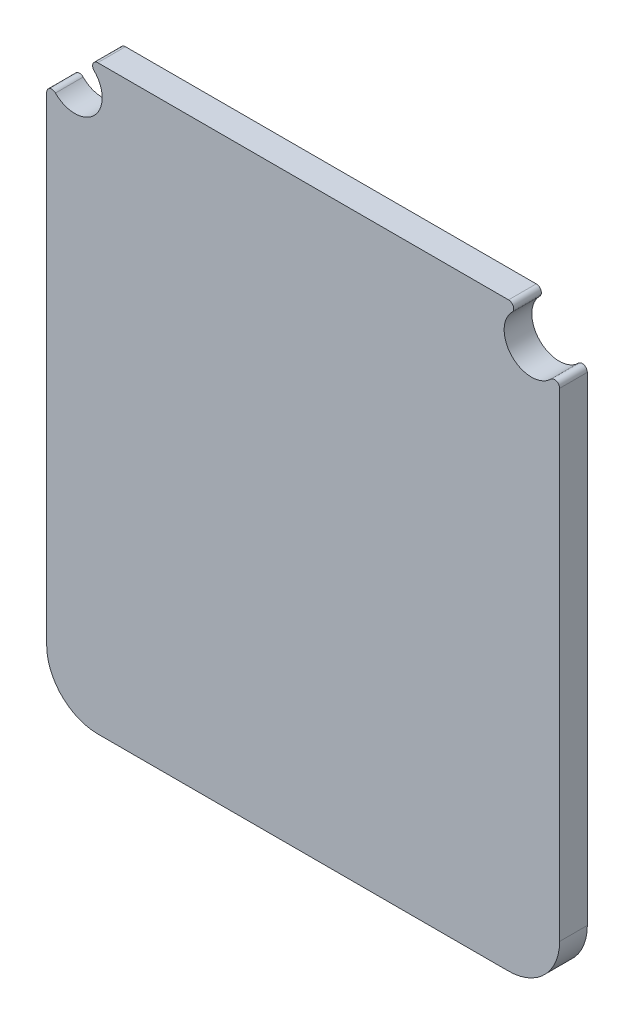
ISO-10303-21;
HEADER;
FILE_DESCRIPTION(('STEP AP214'),'2;1');
FILE_NAME('part.step','',(''),(''),'','','');
FILE_SCHEMA(('AUTOMOTIVE_DESIGN { 1 0 10303 214 1 1 1 1 }'));
ENDSEC;
DATA;
#1=APPLICATION_CONTEXT('core data for automotive mechanical design processes');
#2=APPLICATION_PROTOCOL_DEFINITION('international standard','automotive_design',2000,#1);
#3=PRODUCT_CONTEXT('',#1,'mechanical');
#4=PRODUCT('Part','Part','',(#3));
#5=PRODUCT_RELATED_PRODUCT_CATEGORY('part','',(#4));
#6=PRODUCT_DEFINITION_FORMATION('','',#4);
#7=PRODUCT_DEFINITION_CONTEXT('part definition',#1,'design');
#8=PRODUCT_DEFINITION('design','',#6,#7);
#9=PRODUCT_DEFINITION_SHAPE('','',#8);
#10=(LENGTH_UNIT() NAMED_UNIT(*) SI_UNIT(.MILLI.,.METRE.));
#11=(NAMED_UNIT(*) PLANE_ANGLE_UNIT() SI_UNIT($,.RADIAN.));
#12=(NAMED_UNIT(*) SI_UNIT($,.STERADIAN.) SOLID_ANGLE_UNIT());
#13=UNCERTAINTY_MEASURE_WITH_UNIT(LENGTH_MEASURE(1.E-05),#10,'distance_accuracy_value','');
#14=(GEOMETRIC_REPRESENTATION_CONTEXT(3) GLOBAL_UNCERTAINTY_ASSIGNED_CONTEXT((#13)) GLOBAL_UNIT_ASSIGNED_CONTEXT((#10,
#11,#12)) REPRESENTATION_CONTEXT('',''));
#15=CARTESIAN_POINT('',(0.,0.,0.));
#16=DIRECTION('',(0.,0.,1.));
#17=DIRECTION('',(1.,0.,0.));
#18=AXIS2_PLACEMENT_3D('',#15,#16,#17);
#19=CARTESIAN_POINT('',(13.,29.,1.6194));
#20=DIRECTION('',(0.,0.,-1.));
#21=DIRECTION('',(-1.,0.,0.));
#22=AXIS2_PLACEMENT_3D('',#19,#20,#21);
#23=CYLINDRICAL_SURFACE('',#22,3.);
#24=CARTESIAN_POINT('',(13.,29.,0.));
#25=DIRECTION('',(0.,0.,1.));
#26=DIRECTION('',(-1.,0.,0.));
#27=AXIS2_PLACEMENT_3D('',#24,#25,#26);
#28=CIRCLE('',#27,3.);
#29=CARTESIAN_POINT('',(10.,29.,0.));
#30=VERTEX_POINT('',#29);
#31=CARTESIAN_POINT('',(13.,26.,0.));
#32=VERTEX_POINT('',#31);
#33=EDGE_CURVE('E169',#30,#32,#28,.T.);
#34=ORIENTED_EDGE('',*,*,#33,.T.);
#35=DIRECTION('',(0.,0.,-1.));
#36=VECTOR('',#35,1.);
#37=CARTESIAN_POINT('',(13.,26.,1.6194));
#38=LINE('',#37,#36);
#39=CARTESIAN_POINT('',(13.,26.,1.6194));
#40=VERTEX_POINT('',#39);
#41=EDGE_CURVE('E11',#40,#32,#38,.T.);
#42=ORIENTED_EDGE('',*,*,#41,.F.);
#43=CARTESIAN_POINT('',(13.,29.,1.6194));
#44=DIRECTION('',(0.,0.,1.));
#45=DIRECTION('',(-1.,0.,0.));
#46=AXIS2_PLACEMENT_3D('',#43,#44,#45);
#47=CIRCLE('',#46,3.);
#48=CARTESIAN_POINT('',(10.,29.,1.6194));
#49=VERTEX_POINT('',#48);
#50=EDGE_CURVE('E203',#49,#40,#47,.T.);
#51=ORIENTED_EDGE('',*,*,#50,.F.);
#52=DIRECTION('',(0.,0.,-1.));
#53=VECTOR('',#52,1.);
#54=CARTESIAN_POINT('',(10.,29.,1.6194));
#55=LINE('',#54,#53);
#56=EDGE_CURVE('E165',#49,#30,#55,.T.);
#57=ORIENTED_EDGE('',*,*,#56,.T.);
#58=EDGE_LOOP('',(#34,#42,#51,#57));
#59=FACE_BOUND('',#58,.T.);
#60=ADVANCED_FACE('F44',(#59),#23,.T.);
#61=CARTESIAN_POINT('',(37.,26.,1.6194));
#62=DIRECTION('',(0.,1.,0.));
#63=DIRECTION('',(0.,0.,1.));
#64=AXIS2_PLACEMENT_3D('',#61,#62,#63);
#65=PLANE('',#64);
#66=DIRECTION('',(1.,0.,0.));
#67=VECTOR('',#66,1.);
#68=CARTESIAN_POINT('',(37.,26.,0.));
#69=LINE('',#68,#67);
#70=CARTESIAN_POINT('',(37.,26.,0.));
#71=VERTEX_POINT('',#70);
#72=EDGE_CURVE('E173',#32,#71,#69,.T.);
#73=ORIENTED_EDGE('',*,*,#72,.T.);
#74=DIRECTION('',(0.,0.,-1.));
#75=VECTOR('',#74,1.);
#76=CARTESIAN_POINT('',(37.,26.,1.6194));
#77=LINE('',#76,#75);
#78=CARTESIAN_POINT('',(37.,26.,1.6194));
#79=VERTEX_POINT('',#78);
#80=EDGE_CURVE('E53',#79,#71,#77,.T.);
#81=ORIENTED_EDGE('',*,*,#80,.F.);
#82=DIRECTION('',(1.,0.,0.));
#83=VECTOR('',#82,1.);
#84=CARTESIAN_POINT('',(37.,26.,1.6194));
#85=LINE('',#84,#83);
#86=EDGE_CURVE('E116',#40,#79,#85,.T.);
#87=ORIENTED_EDGE('',*,*,#86,.F.);
#88=ORIENTED_EDGE('',*,*,#41,.T.);
#89=EDGE_LOOP('',(#73,#81,#87,#88));
#90=FACE_BOUND('',#89,.T.);
#91=ADVANCED_FACE('F297',(#90),#65,.F.);
#92=CARTESIAN_POINT('',(37.0000100000167,28.9999899999833,1.6194));
#93=DIRECTION('',(0.,0.,-1.));
#94=DIRECTION('',(-1.,0.,0.));
#95=AXIS2_PLACEMENT_3D('',#92,#93,#94);
#96=CYLINDRICAL_SURFACE('',#95,2.99999);
#97=CARTESIAN_POINT('',(37.0000100000167,28.9999899999833,0.));
#98=DIRECTION('',(0.,0.,1.));
#99=DIRECTION('',(-1.,0.,0.));
#100=AXIS2_PLACEMENT_3D('',#97,#98,#99);
#101=CIRCLE('',#100,2.99999);
#102=CARTESIAN_POINT('',(40.,29.,0.));
#103=VERTEX_POINT('',#102);
#104=EDGE_CURVE('E176',#71,#103,#101,.T.);
#105=ORIENTED_EDGE('',*,*,#104,.T.);
#106=DIRECTION('',(0.,0.,-1.));
#107=VECTOR('',#106,1.);
#108=CARTESIAN_POINT('',(40.,29.,1.6194));
#109=LINE('',#108,#107);
#110=CARTESIAN_POINT('',(40.,29.,1.6194));
#111=VERTEX_POINT('',#110);
#112=EDGE_CURVE('E230',#111,#103,#109,.T.);
#113=ORIENTED_EDGE('',*,*,#112,.F.);
#114=CARTESIAN_POINT('',(37.0000100000167,28.9999899999833,1.6194));
#115=DIRECTION('',(0.,0.,1.));
#116=DIRECTION('',(-1.,0.,0.));
#117=AXIS2_PLACEMENT_3D('',#114,#115,#116);
#118=CIRCLE('',#117,2.99999);
#119=EDGE_CURVE('E240',#79,#111,#118,.T.);
#120=ORIENTED_EDGE('',*,*,#119,.F.);
#121=ORIENTED_EDGE('',*,*,#80,.T.);
#122=EDGE_LOOP('',(#105,#113,#120,#121));
#123=FACE_BOUND('',#122,.T.);
#124=ADVANCED_FACE('F238',(#123),#96,.T.);
#125=CARTESIAN_POINT('',(40.,57.01299,1.6194));
#126=DIRECTION('',(-1.,0.,0.));
#127=DIRECTION('',(0.,0.,1.));
#128=AXIS2_PLACEMENT_3D('',#125,#126,#127);
#129=PLANE('',#128);
#130=DIRECTION('',(0.,1.,0.));
#131=VECTOR('',#130,1.);
#132=CARTESIAN_POINT('',(40.,57.01299,0.));
#133=LINE('',#132,#131);
#134=CARTESIAN_POINT('',(40.,57.01299,0.));
#135=VERTEX_POINT('',#134);
#136=EDGE_CURVE('E179',#103,#135,#133,.T.);
#137=ORIENTED_EDGE('',*,*,#136,.T.);
#138=DIRECTION('',(0.,0.,-1.));
#139=VECTOR('',#138,1.);
#140=CARTESIAN_POINT('',(40.,57.01299,1.6194));
#141=LINE('',#140,#139);
#142=CARTESIAN_POINT('',(40.,57.01299,1.6194));
#143=VERTEX_POINT('',#142);
#144=EDGE_CURVE('E226',#143,#135,#141,.T.);
#145=ORIENTED_EDGE('',*,*,#144,.F.);
#146=DIRECTION('',(0.,1.,0.));
#147=VECTOR('',#146,1.);
#148=CARTESIAN_POINT('',(40.,57.01299,1.6194));
#149=LINE('',#148,#147);
#150=EDGE_CURVE('E259',#111,#143,#149,.T.);
#151=ORIENTED_EDGE('',*,*,#150,.F.);
#152=ORIENTED_EDGE('',*,*,#112,.T.);
#153=EDGE_LOOP('',(#137,#145,#151,#152));
#154=FACE_BOUND('',#153,.T.);
#155=ADVANCED_FACE('F249',(#154),#129,.F.);
#156=CARTESIAN_POINT('',(39.700000000423,57.0130059320103,1.6194));
#157=DIRECTION('',(0.,0.,-1.));
#158=DIRECTION('',(-1.,0.,0.));
#159=AXIS2_PLACEMENT_3D('',#156,#157,#158);
#160=CYLINDRICAL_SURFACE('',#159,0.300000000000002);
#161=CARTESIAN_POINT('',(39.700000000423,57.0130059320103,0.));
#162=DIRECTION('',(0.,0.,1.));
#163=DIRECTION('',(-1.,0.,0.));
#164=AXIS2_PLACEMENT_3D('',#161,#162,#163);
#165=CIRCLE('',#164,0.300000000000002);
#166=CARTESIAN_POINT('',(39.48786,57.22513,0.));
#167=VERTEX_POINT('',#166);
#168=EDGE_CURVE('E182',#135,#167,#165,.T.);
#169=ORIENTED_EDGE('',*,*,#168,.T.);
#170=DIRECTION('',(0.,0.,-1.));
#171=VECTOR('',#170,1.);
#172=CARTESIAN_POINT('',(39.48786,57.22513,1.6194));
#173=LINE('',#172,#171);
#174=CARTESIAN_POINT('',(39.48786,57.22513,1.6194));
#175=VERTEX_POINT('',#174);
#176=EDGE_CURVE('E222',#175,#167,#173,.T.);
#177=ORIENTED_EDGE('',*,*,#176,.F.);
#178=CARTESIAN_POINT('',(39.700000000423,57.0130059320103,1.6194));
#179=DIRECTION('',(0.,0.,1.));
#180=DIRECTION('',(-1.,0.,0.));
#181=AXIS2_PLACEMENT_3D('',#178,#179,#180);
#182=CIRCLE('',#181,0.300000000000002);
#183=EDGE_CURVE('E255',#143,#175,#182,.T.);
#184=ORIENTED_EDGE('',*,*,#183,.F.);
#185=ORIENTED_EDGE('',*,*,#144,.T.);
#186=EDGE_LOOP('',(#169,#177,#184,#185));
#187=FACE_BOUND('',#186,.T.);
#188=ADVANCED_FACE('F253',(#187),#160,.T.);
#189=CARTESIAN_POINT('',(38.35510324119,58.35511324119,1.6194));
#190=DIRECTION('',(0.,0.,-1.));
#191=DIRECTION('',(-1.,0.,0.));
#192=AXIS2_PLACEMENT_3D('',#189,#190,#191);
#193=CYLINDRICAL_SURFACE('',#192,1.6);
#194=CARTESIAN_POINT('',(38.35510324119,58.35511324119,0.));
#195=DIRECTION('',(0.,0.,-1.));
#196=DIRECTION('',(1.,0.,0.));
#197=AXIS2_PLACEMENT_3D('',#194,#195,#196);
#198=CIRCLE('',#197,1.6);
#199=CARTESIAN_POINT('',(37.22512,59.48787,0.));
#200=VERTEX_POINT('',#199);
#201=EDGE_CURVE('E185',#167,#200,#198,.T.);
#202=ORIENTED_EDGE('',*,*,#201,.T.);
#203=DIRECTION('',(0.,0.,-1.));
#204=VECTOR('',#203,1.);
#205=CARTESIAN_POINT('',(37.22512,59.48787,1.6194));
#206=LINE('',#205,#204);
#207=CARTESIAN_POINT('',(37.22512,59.48787,1.6194));
#208=VERTEX_POINT('',#207);
#209=EDGE_CURVE('E218',#208,#200,#206,.T.);
#210=ORIENTED_EDGE('',*,*,#209,.F.);
#211=CARTESIAN_POINT('',(38.35510324119,58.35511324119,1.6194));
#212=DIRECTION('',(0.,0.,-1.));
#213=DIRECTION('',(1.,0.,0.));
#214=AXIS2_PLACEMENT_3D('',#211,#212,#213);
#215=CIRCLE('',#214,1.6);
#216=EDGE_CURVE('E258',#175,#208,#215,.T.);
#217=ORIENTED_EDGE('',*,*,#216,.F.);
#218=ORIENTED_EDGE('',*,*,#176,.T.);
#219=EDGE_LOOP('',(#202,#210,#217,#218));
#220=FACE_BOUND('',#219,.T.);
#221=ADVANCED_FACE('F310',(#220),#193,.F.);
#222=CARTESIAN_POINT('',(37.0129859313352,59.7000000000276,1.6194));
#223=DIRECTION('',(0.,0.,-1.));
#224=DIRECTION('',(-1.,0.,0.));
#225=AXIS2_PLACEMENT_3D('',#222,#223,#224);
#226=CYLINDRICAL_SURFACE('',#225,0.300000000000002);
#227=CARTESIAN_POINT('',(37.0129859313352,59.7000000000276,0.));
#228=DIRECTION('',(0.,0.,1.));
#229=DIRECTION('',(-1.,0.,0.));
#230=AXIS2_PLACEMENT_3D('',#227,#228,#229);
#231=CIRCLE('',#230,0.300000000000002);
#232=CARTESIAN_POINT('',(37.01299,60.,0.));
#233=VERTEX_POINT('',#232);
#234=EDGE_CURVE('E188',#200,#233,#231,.T.);
#235=ORIENTED_EDGE('',*,*,#234,.T.);
#236=DIRECTION('',(0.,0.,-1.));
#237=VECTOR('',#236,1.);
#238=CARTESIAN_POINT('',(37.01299,60.,1.6194));
#239=LINE('',#238,#237);
#240=CARTESIAN_POINT('',(37.01299,60.,1.6194));
#241=VERTEX_POINT('',#240);
#242=EDGE_CURVE('E214',#241,#233,#239,.T.);
#243=ORIENTED_EDGE('',*,*,#242,.F.);
#244=CARTESIAN_POINT('',(37.0129859313352,59.7000000000276,1.6194));
#245=DIRECTION('',(0.,0.,1.));
#246=DIRECTION('',(-1.,0.,0.));
#247=AXIS2_PLACEMENT_3D('',#244,#245,#246);
#248=CIRCLE('',#247,0.300000000000002);
#249=EDGE_CURVE('E263',#208,#241,#248,.T.);
#250=ORIENTED_EDGE('',*,*,#249,.F.);
#251=ORIENTED_EDGE('',*,*,#209,.T.);
#252=EDGE_LOOP('',(#235,#243,#250,#251));
#253=FACE_BOUND('',#252,.T.);
#254=ADVANCED_FACE('F313',(#253),#226,.T.);
#255=CARTESIAN_POINT('',(12.987,60.,1.6194));
#256=DIRECTION('',(0.,-1.,0.));
#257=DIRECTION('',(0.,0.,-1.));
#258=AXIS2_PLACEMENT_3D('',#255,#256,#257);
#259=PLANE('',#258);
#260=DIRECTION('',(-1.,0.,0.));
#261=VECTOR('',#260,1.);
#262=CARTESIAN_POINT('',(12.987,60.,0.));
#263=LINE('',#262,#261);
#264=CARTESIAN_POINT('',(12.987,60.,0.));
#265=VERTEX_POINT('',#264);
#266=EDGE_CURVE('E191',#233,#265,#263,.T.);
#267=ORIENTED_EDGE('',*,*,#266,.T.);
#268=DIRECTION('',(0.,0.,-1.));
#269=VECTOR('',#268,1.);
#270=CARTESIAN_POINT('',(12.987,60.,1.6194));
#271=LINE('',#270,#269);
#272=CARTESIAN_POINT('',(12.987,60.,1.6194));
#273=VERTEX_POINT('',#272);
#274=EDGE_CURVE('E210',#273,#265,#271,.T.);
#275=ORIENTED_EDGE('',*,*,#274,.F.);
#276=DIRECTION('',(-1.,0.,0.));
#277=VECTOR('',#276,1.);
#278=CARTESIAN_POINT('',(12.987,60.,1.6194));
#279=LINE('',#278,#277);
#280=EDGE_CURVE('E270',#241,#273,#279,.T.);
#281=ORIENTED_EDGE('',*,*,#280,.F.);
#282=ORIENTED_EDGE('',*,*,#242,.T.);
#283=EDGE_LOOP('',(#267,#275,#281,#282));
#284=FACE_BOUND('',#283,.T.);
#285=ADVANCED_FACE('F278',(#284),#259,.F.);
#286=CARTESIAN_POINT('',(12.9869940683542,59.7000000000586,1.6194));
#287=DIRECTION('',(0.,0.,-1.));
#288=DIRECTION('',(-1.,0.,0.));
#289=AXIS2_PLACEMENT_3D('',#286,#287,#288);
#290=CYLINDRICAL_SURFACE('',#289,0.299999999999999);
#291=CARTESIAN_POINT('',(12.9869940683542,59.7000000000586,0.));
#292=DIRECTION('',(0.,0.,1.));
#293=DIRECTION('',(-1.,0.,0.));
#294=AXIS2_PLACEMENT_3D('',#291,#292,#293);
#295=CIRCLE('',#294,0.299999999999999);
#296=CARTESIAN_POINT('',(12.77487,59.48786,0.));
#297=VERTEX_POINT('',#296);
#298=EDGE_CURVE('E194',#265,#297,#295,.T.);
#299=ORIENTED_EDGE('',*,*,#298,.T.);
#300=DIRECTION('',(0.,0.,-1.));
#301=VECTOR('',#300,1.);
#302=CARTESIAN_POINT('',(12.77487,59.48786,1.6194));
#303=LINE('',#302,#301);
#304=CARTESIAN_POINT('',(12.77487,59.48786,1.6194));
#305=VERTEX_POINT('',#304);
#306=EDGE_CURVE('E158',#305,#297,#303,.T.);
#307=ORIENTED_EDGE('',*,*,#306,.F.);
#308=CARTESIAN_POINT('',(12.9869940683542,59.7000000000586,1.6194));
#309=DIRECTION('',(0.,0.,1.));
#310=DIRECTION('',(-1.,0.,0.));
#311=AXIS2_PLACEMENT_3D('',#308,#309,#310);
#312=CIRCLE('',#311,0.299999999999999);
#313=EDGE_CURVE('E147',#273,#305,#312,.T.);
#314=ORIENTED_EDGE('',*,*,#313,.F.);
#315=ORIENTED_EDGE('',*,*,#274,.T.);
#316=EDGE_LOOP('',(#299,#307,#314,#315));
#317=FACE_BOUND('',#316,.T.);
#318=ADVANCED_FACE('F282',(#317),#290,.T.);
#319=CARTESIAN_POINT('',(11.6462531625457,58.3537418252868,1.6194));
#320=DIRECTION('',(0.,0.,-1.));
#321=DIRECTION('',(-1.,0.,0.));
#322=AXIS2_PLACEMENT_3D('',#319,#320,#321);
#323=CYLINDRICAL_SURFACE('',#322,1.6);
#324=CARTESIAN_POINT('',(11.6462531625457,58.3537418252868,0.));
#325=DIRECTION('',(0.,0.,-1.));
#326=DIRECTION('',(1.,0.,0.));
#327=AXIS2_PLACEMENT_3D('',#324,#325,#326);
#328=CIRCLE('',#327,1.6);
#329=CARTESIAN_POINT('',(10.51213,57.22513,0.));
#330=VERTEX_POINT('',#329);
#331=EDGE_CURVE('E156',#297,#330,#328,.T.);
#332=ORIENTED_EDGE('',*,*,#331,.T.);
#333=DIRECTION('',(0.,0.,-1.));
#334=VECTOR('',#333,1.);
#335=CARTESIAN_POINT('',(10.51213,57.22513,1.6194));
#336=LINE('',#335,#334);
#337=CARTESIAN_POINT('',(10.51213,57.22513,1.6194));
#338=VERTEX_POINT('',#337);
#339=EDGE_CURVE('E153',#338,#330,#336,.T.);
#340=ORIENTED_EDGE('',*,*,#339,.F.);
#341=CARTESIAN_POINT('',(11.6462531625457,58.3537418252868,1.6194));
#342=DIRECTION('',(0.,0.,-1.));
#343=DIRECTION('',(1.,0.,0.));
#344=AXIS2_PLACEMENT_3D('',#341,#342,#343);
#345=CIRCLE('',#344,1.6);
#346=EDGE_CURVE('E141',#305,#338,#345,.T.);
#347=ORIENTED_EDGE('',*,*,#346,.F.);
#348=ORIENTED_EDGE('',*,*,#306,.T.);
#349=EDGE_LOOP('',(#332,#340,#347,#348));
#350=FACE_BOUND('',#349,.T.);
#351=ADVANCED_FACE('F154',(#350),#323,.F.);
#352=CARTESIAN_POINT('',(10.2999999999414,57.0129959313662,1.6194));
#353=DIRECTION('',(0.,0.,-1.));
#354=DIRECTION('',(-1.,0.,0.));
#355=AXIS2_PLACEMENT_3D('',#352,#353,#354);
#356=CYLINDRICAL_SURFACE('',#355,0.300000000000002);
#357=CARTESIAN_POINT('',(10.2999999999414,57.0129959313662,0.));
#358=DIRECTION('',(0.,0.,1.));
#359=DIRECTION('',(-1.,0.,0.));
#360=AXIS2_PLACEMENT_3D('',#357,#358,#359);
#361=CIRCLE('',#360,0.300000000000002);
#362=CARTESIAN_POINT('',(10.,57.01299,0.));
#363=VERTEX_POINT('',#362);
#364=EDGE_CURVE('E102',#330,#363,#361,.T.);
#365=ORIENTED_EDGE('',*,*,#364,.T.);
#366=DIRECTION('',(0.,0.,-1.));
#367=VECTOR('',#366,1.);
#368=CARTESIAN_POINT('',(10.,57.01299,1.6194));
#369=LINE('',#368,#367);
#370=CARTESIAN_POINT('',(10.,57.01299,1.6194));
#371=VERTEX_POINT('',#370);
#372=EDGE_CURVE('E159',#371,#363,#369,.T.);
#373=ORIENTED_EDGE('',*,*,#372,.F.);
#374=CARTESIAN_POINT('',(10.2999999999414,57.0129959313662,1.6194));
#375=DIRECTION('',(0.,0.,1.));
#376=DIRECTION('',(-1.,0.,0.));
#377=AXIS2_PLACEMENT_3D('',#374,#375,#376);
#378=CIRCLE('',#377,0.300000000000002);
#379=EDGE_CURVE('E145',#338,#371,#378,.T.);
#380=ORIENTED_EDGE('',*,*,#379,.F.);
#381=ORIENTED_EDGE('',*,*,#339,.T.);
#382=EDGE_LOOP('',(#365,#373,#380,#381));
#383=FACE_BOUND('',#382,.T.);
#384=ADVANCED_FACE('F161',(#383),#356,.T.);
#385=CARTESIAN_POINT('',(10.,29.,1.6194));
#386=DIRECTION('',(1.,0.,0.));
#387=DIRECTION('',(0.,0.,-1.));
#388=AXIS2_PLACEMENT_3D('',#385,#386,#387);
#389=PLANE('',#388);
#390=DIRECTION('',(0.,-1.,0.));
#391=VECTOR('',#390,1.);
#392=CARTESIAN_POINT('',(10.,29.,0.));
#393=LINE('',#392,#391);
#394=EDGE_CURVE('E108',#363,#30,#393,.T.);
#395=ORIENTED_EDGE('',*,*,#394,.T.);
#396=ORIENTED_EDGE('',*,*,#56,.F.);
#397=DIRECTION('',(0.,-1.,0.));
#398=VECTOR('',#397,1.);
#399=CARTESIAN_POINT('',(10.,29.,1.6194));
#400=LINE('',#399,#398);
#401=EDGE_CURVE('E61',#371,#49,#400,.T.);
#402=ORIENTED_EDGE('',*,*,#401,.F.);
#403=ORIENTED_EDGE('',*,*,#372,.T.);
#404=EDGE_LOOP('',(#395,#396,#402,#403));
#405=FACE_BOUND('',#404,.T.);
#406=ADVANCED_FACE('F286',(#405),#389,.F.);
#407=CARTESIAN_POINT('',(13.,29.,1.6194));
#408=DIRECTION('',(0.,0.,-1.));
#409=DIRECTION('',(-1.,0.,0.));
#410=AXIS2_PLACEMENT_3D('',#407,#408,#409);
#411=PLANE('',#410);
#412=ORIENTED_EDGE('',*,*,#50,.T.);
#413=ORIENTED_EDGE('',*,*,#86,.T.);
#414=ORIENTED_EDGE('',*,*,#119,.T.);
#415=ORIENTED_EDGE('',*,*,#150,.T.);
#416=ORIENTED_EDGE('',*,*,#183,.T.);
#417=ORIENTED_EDGE('',*,*,#216,.T.);
#418=ORIENTED_EDGE('',*,*,#249,.T.);
#419=ORIENTED_EDGE('',*,*,#280,.T.);
#420=ORIENTED_EDGE('',*,*,#313,.T.);
#421=ORIENTED_EDGE('',*,*,#346,.T.);
#422=ORIENTED_EDGE('',*,*,#379,.T.);
#423=ORIENTED_EDGE('',*,*,#401,.T.);
#424=EDGE_LOOP('',(#412,#413,#414,#415,#416,#417,#418,#419,#420,#421,#422,#423));
#425=FACE_BOUND('',#424,.T.);
#426=ADVANCED_FACE('F143',(#425),#411,.F.);
#427=CARTESIAN_POINT('',(13.,29.,0.));
#428=DIRECTION('',(0.,0.,-1.));
#429=DIRECTION('',(-1.,0.,0.));
#430=AXIS2_PLACEMENT_3D('',#427,#428,#429);
#431=PLANE('',#430);
#432=ORIENTED_EDGE('',*,*,#33,.F.);
#433=ORIENTED_EDGE('',*,*,#394,.F.);
#434=ORIENTED_EDGE('',*,*,#364,.F.);
#435=ORIENTED_EDGE('',*,*,#331,.F.);
#436=ORIENTED_EDGE('',*,*,#298,.F.);
#437=ORIENTED_EDGE('',*,*,#266,.F.);
#438=ORIENTED_EDGE('',*,*,#234,.F.);
#439=ORIENTED_EDGE('',*,*,#201,.F.);
#440=ORIENTED_EDGE('',*,*,#168,.F.);
#441=ORIENTED_EDGE('',*,*,#136,.F.);
#442=ORIENTED_EDGE('',*,*,#104,.F.);
#443=ORIENTED_EDGE('',*,*,#72,.F.);
#444=EDGE_LOOP('',(#432,#433,#434,#435,#436,#437,#438,#439,#440,#441,#442,#443));
#445=FACE_BOUND('',#444,.T.);
#446=ADVANCED_FACE('F244',(#445),#431,.T.);
#447=CLOSED_SHELL('',(#60,#91,#124,#155,#188,#221,#254,#285,#318,#351,#384,#406,#426,#446));
#448=MANIFOLD_SOLID_BREP('B2',#447);
#449=ADVANCED_BREP_SHAPE_REPRESENTATION('',(#18,#448),#14);
#450=SHAPE_DEFINITION_REPRESENTATION(#9,#449);
ENDSEC;
END-ISO-10303-21;
